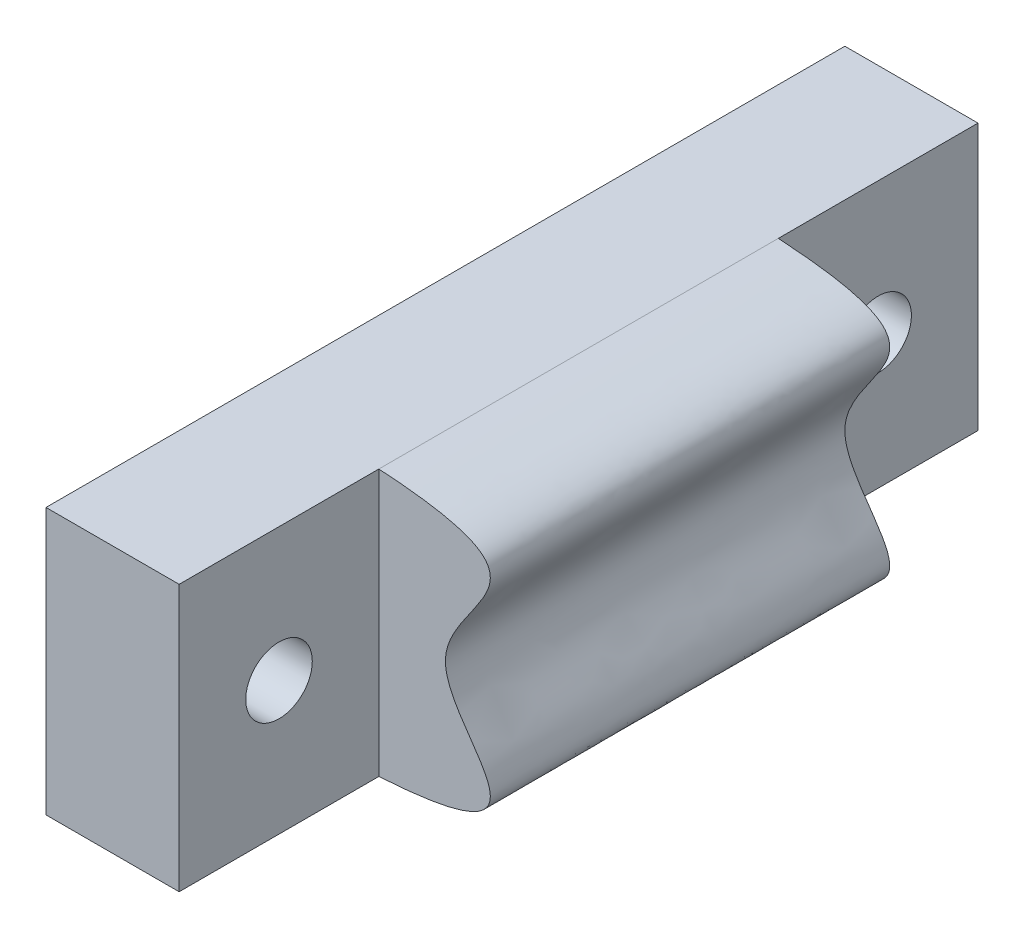
ISO-10303-21;
HEADER;
FILE_DESCRIPTION(('STEP AP214'),'2;1');
FILE_NAME('part.step','',(''),(''),'','','');
FILE_SCHEMA(('AUTOMOTIVE_DESIGN { 1 0 10303 214 1 1 1 1 }'));
ENDSEC;
DATA;
#1=APPLICATION_CONTEXT('core data for automotive mechanical design processes');
#2=APPLICATION_PROTOCOL_DEFINITION('international standard','automotive_design',2000,#1);
#3=PRODUCT_CONTEXT('',#1,'mechanical');
#4=PRODUCT('Part','Part','',(#3));
#5=PRODUCT_RELATED_PRODUCT_CATEGORY('part','',(#4));
#6=PRODUCT_DEFINITION_FORMATION('','',#4);
#7=PRODUCT_DEFINITION_CONTEXT('part definition',#1,'design');
#8=PRODUCT_DEFINITION('design','',#6,#7);
#9=PRODUCT_DEFINITION_SHAPE('','',#8);
#10=(LENGTH_UNIT() NAMED_UNIT(*) SI_UNIT(.MILLI.,.METRE.));
#11=(NAMED_UNIT(*) PLANE_ANGLE_UNIT() SI_UNIT($,.RADIAN.));
#12=(NAMED_UNIT(*) SI_UNIT($,.STERADIAN.) SOLID_ANGLE_UNIT());
#13=UNCERTAINTY_MEASURE_WITH_UNIT(LENGTH_MEASURE(1.E-05),#10,'distance_accuracy_value','');
#14=(GEOMETRIC_REPRESENTATION_CONTEXT(3) GLOBAL_UNCERTAINTY_ASSIGNED_CONTEXT((#13)) GLOBAL_UNIT_ASSIGNED_CONTEXT((#10,
#11,#12)) REPRESENTATION_CONTEXT('',''));
#15=CARTESIAN_POINT('',(0.,0.,0.));
#16=DIRECTION('',(0.,0.,1.));
#17=DIRECTION('',(1.,0.,0.));
#18=AXIS2_PLACEMENT_3D('',#15,#16,#17);
#19=CARTESIAN_POINT('',(6.35,-12.7,76.2));
#20=CARTESIAN_POINT('',(25.71525174844,-11.5044863284385,76.2));
#21=CARTESIAN_POINT('',(-0.315251748439956,0.,76.2));
#22=CARTESIAN_POINT('',(25.71525174844,11.5044863284385,76.2));
#23=CARTESIAN_POINT('',(6.35,12.7,76.2));
#24=B_SPLINE_CURVE_WITH_KNOTS('',3,(#19,#20,#21,#22,#23),.UNSPECIFIED.,.F.,.F.,(4,1,4),(0.,0.5,
1.),.UNSPECIFIED.);
#25=DIRECTION('',(0.,0.,-1.));
#26=VECTOR('',#25,1.);
#27=SURFACE_OF_LINEAR_EXTRUSION('',#24,#26);
#28=CARTESIAN_POINT('',(6.35,12.7,19.05));
#29=CARTESIAN_POINT('',(6.59042784638858,12.6851486091138,19.05));
#30=CARTESIAN_POINT('',(6.83079729121116,12.6693067910446,19.05));
#31=CARTESIAN_POINT('',(7.31216673099985,12.6353112674344,19.05));
#32=CARTESIAN_POINT('',(7.55316619965954,12.6171501295011,19.05));
#33=CARTESIAN_POINT('',(8.03551660957306,12.5782341399885,19.05));
#34=CARTESIAN_POINT('',(8.27686707928766,12.5574734022697,19.05));
#35=CARTESIAN_POINT('',(8.7596327181866,12.5130057301667,19.05));
#36=CARTESIAN_POINT('',(9.00104751987589,12.4892947832721,19.05));
#37=CARTESIAN_POINT('',(9.48364948176947,12.438500801537,19.05));
#38=CARTESIAN_POINT('',(9.72483646195453,12.4114160451251,19.05));
#39=CARTESIAN_POINT('',(10.2068871728875,12.3533187497638,19.05));
#40=CARTESIAN_POINT('',(10.4477506229266,12.322303864329,19.05));
#41=CARTESIAN_POINT('',(10.9286972043699,12.2556775914973,19.05));
#42=CARTESIAN_POINT('',(11.1687807200965,12.2200690000518,19.05));
#43=CARTESIAN_POINT('',(11.6478526504472,12.1433604360711,19.05));
#44=CARTESIAN_POINT('',(11.8868418670211,12.1022655259011,19.05));
#45=CARTESIAN_POINT('',(12.363352463959,12.0133712919053,19.05));
#46=CARTESIAN_POINT('',(12.6008749946784,11.965578185614,19.05));
#47=CARTESIAN_POINT('',(13.0740273187668,11.8615881566732,19.05));
#48=CARTESIAN_POINT('',(13.3096577341428,11.8053941257764,19.05));
#49=CARTESIAN_POINT('',(13.6725787844795,11.7098825073265,19.05));
#50=CARTESIAN_POINT('',(13.8008690658955,11.6743621849815,19.05));
#51=CARTESIAN_POINT('',(14.0563451587935,11.5994554540191,19.05));
#52=CARTESIAN_POINT('',(14.1835308034997,11.5600684722977,19.05));
#53=CARTESIAN_POINT('',(14.4372681119949,11.4764487115584,19.05));
#54=CARTESIAN_POINT('',(14.5638096072557,11.432184845445,19.05));
#55=CARTESIAN_POINT('',(14.8148111484126,11.3381099045429,19.05));
#56=CARTESIAN_POINT('',(14.9392715004484,11.2882996540421,19.05));
#57=CARTESIAN_POINT('',(15.1874447938806,11.1809917107246,19.05));
#58=CARTESIAN_POINT('',(15.3111069862292,11.1233752637353,19.05));
#59=CARTESIAN_POINT('',(15.5541890828716,10.9994145159972,19.05));
#60=CARTESIAN_POINT('',(15.6736049833975,10.933062241729,19.05));
#61=CARTESIAN_POINT('',(15.9047847620829,10.7901630550656,19.05));
#62=CARTESIAN_POINT('',(16.0166086415941,10.713714943614,19.05));
#63=CARTESIAN_POINT('',(16.2299818204799,10.5478265310336,19.05));
#64=CARTESIAN_POINT('',(16.3315571907641,10.458420682417,19.05));
#65=CARTESIAN_POINT('',(16.5004897941862,10.2834164706421,19.05));
#66=CARTESIAN_POINT('',(16.5706390092464,10.2005747946956,19.05));
#67=CARTESIAN_POINT('',(16.6653484118405,10.0688135237832,19.05));
#68=CARTESIAN_POINT('',(16.6951657638259,10.0236433980342,19.05));
#69=CARTESIAN_POINT('',(16.7508235724111,9.93092701267313,19.05));
#70=CARTESIAN_POINT('',(16.7766658518275,9.88338185549005,19.05));
#71=CARTESIAN_POINT('',(16.8241430777735,9.78575441661989,19.05));
#72=CARTESIAN_POINT('',(16.8457423696507,9.73565474963264,19.05));
#73=CARTESIAN_POINT('',(16.8841551122953,9.63365287672314,19.05));
#74=CARTESIAN_POINT('',(16.9009687506723,9.58175074155169,19.05));
#75=CARTESIAN_POINT('',(16.9296738829585,9.47658603421905,19.05));
#76=CARTESIAN_POINT('',(16.9415637001548,9.42332300517607,19.05));
#77=CARTESIAN_POINT('',(16.9604673887898,9.31594095293583,19.05));
#78=CARTESIAN_POINT('',(16.9674806823452,9.2618218290656,19.05));
#79=CARTESIAN_POINT('',(16.9776080628006,9.14444777921161,19.05));
#80=CARTESIAN_POINT('',(16.9799135886404,9.08112346190272,19.05));
#81=CARTESIAN_POINT('',(16.9788121199908,8.954519480085,19.05));
#82=CARTESIAN_POINT('',(16.9754025902639,8.89123984785769,19.05));
#83=CARTESIAN_POINT('',(16.963530195346,8.76505927701433,19.05));
#84=CARTESIAN_POINT('',(16.9550584332405,8.70215920253764,19.05));
#85=CARTESIAN_POINT('',(16.933737748447,8.57712694524289,19.05));
#86=CARTESIAN_POINT('',(16.9208889811999,8.5149947352368,19.05));
#87=CARTESIAN_POINT('',(16.8726167908278,8.31258379647794,19.05));
#88=CARTESIAN_POINT('',(16.8293609012574,8.17416642184426,19.05));
#89=CARTESIAN_POINT('',(16.7295737329903,7.90216776066648,19.05));
#90=CARTESIAN_POINT('',(16.6730173820525,7.76859616448499,19.05));
#91=CARTESIAN_POINT('',(16.5504066047323,7.50494362005501,19.05));
#92=CARTESIAN_POINT('',(16.4842956902542,7.37488931622632,19.05));
#93=CARTESIAN_POINT('',(16.345748355195,7.11841896261184,19.05));
#94=CARTESIAN_POINT('',(16.2733184485427,6.99199934070204,19.05));
#95=CARTESIAN_POINT('',(16.1426680869893,6.77309198760302,19.05));
#96=CARTESIAN_POINT('',(16.0854192012478,6.68001860292257,19.05));
#97=CARTESIAN_POINT('',(15.9690206663383,6.4950651794787,19.05));
#98=CARTESIAN_POINT('',(15.9098709308332,6.40318519518681,19.05));
#99=CARTESIAN_POINT('',(15.730309844506,6.12886398570775,19.05));
#100=CARTESIAN_POINT('',(15.6078170677741,5.94779126363268,19.05));
#101=CARTESIAN_POINT('',(15.3601150051994,5.58704083336464,19.05));
#102=CARTESIAN_POINT('',(15.2349010618719,5.4073663725095,19.05));
#103=CARTESIAN_POINT('',(14.9843446095797,5.04815043102188,19.05));
#104=CARTESIAN_POINT('',(14.8590021259288,4.86860893304327,19.05));
#105=CARTESIAN_POINT('',(14.6106008794613,4.50864171188273,19.05));
#106=CARTESIAN_POINT('',(14.4875369652071,4.3282195698727,19.05));
#107=CARTESIAN_POINT('',(14.2454733443937,3.9646747207015,19.05));
#108=CARTESIAN_POINT('',(14.1264731761072,3.78155232375413,19.05));
#109=CARTESIAN_POINT('',(13.8951133427065,3.41160068161481,19.05));
#110=CARTESIAN_POINT('',(13.7827416945253,3.22477899544818,19.05));
#111=CARTESIAN_POINT('',(13.5673177384189,2.84587051206603,19.05));
#112=CARTESIAN_POINT('',(13.4642612456526,2.6537861301712,19.05));
#113=CARTESIAN_POINT('',(13.2915606493946,2.30440039046037,19.05));
#114=CARTESIAN_POINT('',(13.2194574138961,2.14832400028748,19.05));
#115=CARTESIAN_POINT('',(13.0856545273869,1.83162064386352,19.05));
#116=CARTESIAN_POINT('',(13.0239598317834,1.67099155238136,19.05));
#117=CARTESIAN_POINT('',(12.9142626740997,1.34625836700613,19.05));
#118=CARTESIAN_POINT('',(12.8661711341422,1.18218481412932,19.05));
#119=CARTESIAN_POINT('',(12.7864948482938,0.850055293014299,19.05));
#120=CARTESIAN_POINT('',(12.7548967993124,0.682002648909292,19.05));
#121=CARTESIAN_POINT('',(12.7224630900641,0.427862605623435,19.05));
#122=CARTESIAN_POINT('',(12.7141447671754,0.342700060604403,19.05));
#123=CARTESIAN_POINT('',(12.7029242195879,0.17201068430444,19.05));
#124=CARTESIAN_POINT('',(12.7000214655925,0.0864838894428777,19.05));
#125=CARTESIAN_POINT('',(12.6999787804678,-0.0845459280890896,19.05));
#126=CARTESIAN_POINT('',(12.702837273811,-0.17004895086514,19.05));
#127=CARTESIAN_POINT('',(12.7139835932115,-0.340874413806422,19.05));
#128=CARTESIAN_POINT('',(12.7222829818152,-0.426196080301704,19.05));
#129=CARTESIAN_POINT('',(12.7439180346471,-0.596227217541584,19.05));
#130=CARTESIAN_POINT('',(12.7572557606415,-0.680936423175517,19.05));
#131=CARTESIAN_POINT('',(12.7885294486524,-0.849508039007428,19.05));
#132=CARTESIAN_POINT('',(12.8064662918641,-0.933370283722814,19.05));
#133=CARTESIAN_POINT('',(12.8564020491618,-1.14136557509397,19.05));
#134=CARTESIAN_POINT('',(12.8909667759371,-1.26488504663358,19.05));
#135=CARTESIAN_POINT('',(12.9679637566536,-1.50945772818059,19.05));
#136=CARTESIAN_POINT('',(13.010398963989,-1.6305099933814,19.05));
#137=CARTESIAN_POINT('',(13.101865770417,-1.87011610984887,19.05));
#138=CARTESIAN_POINT('',(13.1508992240181,-1.98866924783423,19.05));
#139=CARTESIAN_POINT('',(13.2546967112538,-2.2239137396866,19.05));
#140=CARTESIAN_POINT('',(13.3094875577953,-2.34059317593437,19.05));
#141=CARTESIAN_POINT('',(13.4236175029598,-2.5716341091507,19.05));
#142=CARTESIAN_POINT('',(13.4829547382186,-2.68599653171698,19.05));
#143=CARTESIAN_POINT('',(13.6053617767292,-2.91264057739806,19.05));
#144=CARTESIAN_POINT('',(13.6684301934706,-3.02492295334472,19.05));
#145=CARTESIAN_POINT('',(13.8415666969623,-3.32349879933655,19.05));
#146=CARTESIAN_POINT('',(13.9544189925907,-3.50817460643326,19.05));
#147=CARTESIAN_POINT('',(14.1860272269202,-3.87381136376711,19.05));
#148=CARTESIAN_POINT('',(14.304784832236,-4.05477124469001,19.05));
#149=CARTESIAN_POINT('',(14.5460818478106,-4.41445371518038,19.05));
#150=CARTESIAN_POINT('',(14.6686256747832,-4.59317332149776,19.05));
#151=CARTESIAN_POINT('',(14.9154916545184,-4.94974584879362,19.05));
#152=CARTESIAN_POINT('',(15.0398160822621,-5.1275971817283,19.05));
#153=CARTESIAN_POINT('',(15.2871958481321,-5.48245866256782,19.05));
#154=CARTESIAN_POINT('',(15.410254174044,-5.65946672776899,19.05));
#155=CARTESIAN_POINT('',(15.6535250516805,-6.01524869395567,19.05));
#156=CARTESIAN_POINT('',(15.7737398045538,-6.19402106644454,19.05));
#157=CARTESIAN_POINT('',(15.9495920148884,-6.46482814684223,19.05));
#158=CARTESIAN_POINT('',(16.0074069212299,-6.55544348203739,19.05));
#159=CARTESIAN_POINT('',(16.1210823041173,-6.73788879954552,19.05));
#160=CARTESIAN_POINT('',(16.1769429123926,-6.82971869941359,19.05));
#161=CARTESIAN_POINT('',(16.2860342826741,-7.01478568652309,19.05));
#162=CARTESIAN_POINT('',(16.3392681221281,-7.10802095155358,19.05));
#163=CARTESIAN_POINT('',(16.4423843048995,-7.29631889865157,19.05));
#164=CARTESIAN_POINT('',(16.4922673359164,-7.39138120056653,19.05));
#165=CARTESIAN_POINT('',(16.5728937572965,-7.55393294119716,19.05));
#166=CARTESIAN_POINT('',(16.604783516398,-7.62085269175014,19.05));
#167=CARTESIAN_POINT('',(16.6660457150327,-7.75586368971007,19.05));
#168=CARTESIAN_POINT('',(16.6954174723218,-7.82395524865159,19.05));
#169=CARTESIAN_POINT('',(16.7511745604178,-7.96156303254377,19.05));
#170=CARTESIAN_POINT('',(16.7775520269563,-8.03108246748831,19.05));
#171=CARTESIAN_POINT('',(16.8265746119746,-8.17143557805991,19.05));
#172=CARTESIAN_POINT('',(16.8492198393133,-8.24226921528832,19.05));
#173=CARTESIAN_POINT('',(16.8902808819013,-8.38630522183876,19.05));
#174=CARTESIAN_POINT('',(16.9086291275314,-8.45952713377872,19.05));
#175=CARTESIAN_POINT('',(16.939665690286,-8.60719830447996,19.05));
#176=CARTESIAN_POINT('',(16.9523532240015,-8.68164773164458,19.05));
#177=CARTESIAN_POINT('',(16.9709013112331,-8.83112576531166,19.05));
#178=CARTESIAN_POINT('',(16.9767883510568,-8.90615097131389,19.05));
#179=CARTESIAN_POINT('',(16.9806704136888,-9.0564038162815,19.05));
#180=CARTESIAN_POINT('',(16.978671072723,-9.13163127229228,19.05));
#181=CARTESIAN_POINT('',(16.9679321502818,-9.25691868878651,19.05));
#182=CARTESIAN_POINT('',(16.9616015131981,-9.30719092016678,19.05));
#183=CARTESIAN_POINT('',(16.9447478191422,-9.40702659982085,19.05));
#184=CARTESIAN_POINT('',(16.9342256443497,-9.45659019496672,19.05));
#185=CARTESIAN_POINT('',(16.9089316977791,-9.55460718612092,19.05));
#186=CARTESIAN_POINT('',(16.8941611533443,-9.60306089841305,19.05));
#187=CARTESIAN_POINT('',(16.8604494421327,-9.69851204919213,19.05));
#188=CARTESIAN_POINT('',(16.8415068945815,-9.74550899965824,19.05));
#189=CARTESIAN_POINT('',(16.7997469444525,-9.83754543260496,19.05));
#190=CARTESIAN_POINT('',(16.7769435096793,-9.88259126102047,19.05));
#191=CARTESIAN_POINT('',(16.7277366187068,-9.97068017593033,19.05));
#192=CARTESIAN_POINT('',(16.7013316549594,-10.0137224135768,19.05));
#193=CARTESIAN_POINT('',(16.6172028601415,-10.1397220445346,19.05));
#194=CARTESIAN_POINT('',(16.5546047402777,-10.2194672975734,19.05));
#195=CARTESIAN_POINT('',(16.4326715736294,-10.3556756405489,19.05));
#196=CARTESIAN_POINT('',(16.3750008717521,-10.4136750614401,19.05));
#197=CARTESIAN_POINT('',(16.2548234394676,-10.5242944906707,19.05));
#198=CARTESIAN_POINT('',(16.19232089071,-10.5769190610235,19.05));
#199=CARTESIAN_POINT('',(16.0633601460733,-10.6775430264651,19.05));
#200=CARTESIAN_POINT('',(15.9968880844935,-10.7255244651979,19.05));
#201=CARTESIAN_POINT('',(15.8610659002617,-10.817213672676,19.05));
#202=CARTESIAN_POINT('',(15.7917152642655,-10.8609206744445,19.05));
#203=CARTESIAN_POINT('',(15.5927031534406,-10.9791019261101,19.05));
#204=CARTESIAN_POINT('',(15.4604622108911,-11.0492300300963,19.05));
#205=CARTESIAN_POINT('',(15.1911374745231,-11.1798091881666,19.05));
#206=CARTESIAN_POINT('',(15.0540461684471,-11.2402443502142,19.05));
#207=CARTESIAN_POINT('',(14.7766048524188,-11.3533775100854,19.05));
#208=CARTESIAN_POINT('',(14.6362522357566,-11.4060690536644,19.05));
#209=CARTESIAN_POINT('',(14.3519008645872,-11.5056613231334,19.05));
#210=CARTESIAN_POINT('',(14.2078794081643,-11.5524964759976,19.05));
#211=CARTESIAN_POINT('',(13.9183978178534,-11.6408371008842,19.05));
#212=CARTESIAN_POINT('',(13.7729394460322,-11.6823483945279,19.05));
#213=CARTESIAN_POINT('',(13.4809005344559,-11.7609561290278,19.05));
#214=CARTESIAN_POINT('',(13.3343204206373,-11.7980541649427,19.05));
#215=CARTESIAN_POINT('',(12.9951017119061,-11.8793570702382,19.05));
#216=CARTESIAN_POINT('',(12.8021481763637,-11.9222437248258,19.05));
#217=CARTESIAN_POINT('',(12.4151173258233,-12.0028154960331,19.05));
#218=CARTESIAN_POINT('',(12.221039727684,-12.0404992369093,19.05));
#219=CARTESIAN_POINT('',(11.8319726176491,-12.1115259671534,19.05));
#220=CARTESIAN_POINT('',(11.6369826151964,-12.1448662522471,19.05));
#221=CARTESIAN_POINT('',(11.2462758969351,-12.2078584219084,19.05));
#222=CARTESIAN_POINT('',(11.0505587775004,-12.2375077859848,19.05));
#223=CARTESIAN_POINT('',(10.658559166077,-12.293624843648,19.05));
#224=CARTESIAN_POINT('',(10.4622764180548,-12.3200907387459,19.05));
#225=CARTESIAN_POINT('',(10.0692909276253,-12.3702445010532,19.05));
#226=CARTESIAN_POINT('',(9.87258806606556,-12.3939314299739,19.05));
#227=CARTESIAN_POINT('',(9.49108213658496,-12.4374639423518,19.05));
#228=CARTESIAN_POINT('',(9.30629575139044,-12.4574565161464,19.05));
#229=CARTESIAN_POINT('',(8.93657775725389,-12.4955086766502,19.05));
#230=CARTESIAN_POINT('',(8.75164620445941,-12.5135688107143,19.05));
#231=CARTESIAN_POINT('',(8.38175370034258,-12.5479446831651,19.05));
#232=CARTESIAN_POINT('',(8.19679286253431,-12.5642616475335,19.05));
#233=CARTESIAN_POINT('',(7.82695520592179,-12.5953123384825,19.05));
#234=CARTESIAN_POINT('',(7.64207853927486,-12.6100478829551,19.05));
#235=CARTESIAN_POINT('',(7.27252115946913,-12.6380763621326,19.05));
#236=CARTESIAN_POINT('',(7.08784062194907,-12.651371622263,19.05));
#237=CARTESIAN_POINT('',(6.71878504644686,-12.676638375484,19.05));
#238=CARTESIAN_POINT('',(6.53441019811627,-12.688612634418,19.05));
#239=CARTESIAN_POINT('',(6.35,-12.7,19.05));
#240=B_SPLINE_CURVE_WITH_KNOTS('',3,(#28,#29,#30,#31,#32,#33,#34,#35,#36,#37,#38,#39,#40,#41,
#42,#43,#44,#45,#46,#47,#48,#49,#50,#51,#52,#53,#54,#55,#56,#57,#58,#59,#60,#61,#62,#63,#64,#65,
#66,#67,#68,#69,#70,#71,#72,#73,#74,#75,#76,#77,#78,#79,#80,#81,#82,#83,#84,#85,#86,#87,#88,#89,
#90,#91,#92,#93,#94,#95,#96,#97,#98,#99,#100,#101,#102,#103,#104,#105,#106,#107,#108,#109,#110,
#111,#112,#113,#114,#115,#116,#117,#118,#119,#120,#121,#122,#123,#124,#125,#126,#127,#128,#129,
#130,#131,#132,#133,#134,#135,#136,#137,#138,#139,#140,#141,#142,#143,#144,#145,#146,#147,#148,
#149,#150,#151,#152,#153,#154,#155,#156,#157,#158,#159,#160,#161,#162,#163,#164,#165,#166,#167,
#168,#169,#170,#171,#172,#173,#174,#175,#176,#177,#178,#179,#180,#181,#182,#183,#184,#185,#186,
#187,#188,#189,#190,#191,#192,#193,#194,#195,#196,#197,#198,#199,#200,#201,#202,#203,#204,#205,
#206,#207,#208,#209,#210,#211,#212,#213,#214,#215,#216,#217,#218,#219,#220,#221,#222,#223,#224,
#225,#226,#227,#228,#229,#230,#231,#232,#233,#234,#235,#236,#237,#238,#239),.UNSPECIFIED.,.F.,
.F.,(4,2,2,2,2,2,2,2,2,2,2,2,2,2,2,2,2,2,2,2,2,2,2,2,2,2,2,2,2,2,2,2,2,2,2,2,2,2,2,2,2,2,2,2,2,
2,2,2,2,2,2,2,2,2,2,2,2,2,2,2,2,2,2,2,2,2,2,2,2,2,2,2,2,2,2,2,2,2,2,2,2,2,2,2,2,2,2,2,2,2,2,2,2,
2,2,2,2,2,2,2,2,2,2,2,2,4),(0.,0.722660378639619,1.44769757534735,2.17440717288135,
2.90211618241953,3.6301980568075,4.35871669928291,5.0867940038795,5.81420407749095,
6.54094335766948,7.2674330543536,7.66673579479884,8.06609780824295,8.46817149283465,
8.87018550193007,9.27919949959204,9.68858944195853,10.0942347285194,10.49882061068,
10.8232280669674,10.985431193505,11.147559716709,11.3109972656844,11.4744284066146,
11.6379151552141,11.8014212742014,11.9912252451896,12.1811134367957,12.371336344087,
12.5615524966843,12.9954602111579,13.4301925209131,13.8676090066968,14.3045797927721,
14.6323662303481,14.9601675771893,15.6159451952043,16.2729508475821,16.9298454282409,
17.5850074263638,18.240094734919,18.8939589907065,19.547528022084,20.0630190985723,
20.5787549071147,21.091030900573,21.602893068633,21.8594540487168,22.1159899522181,
22.3724557104022,22.6294682631476,22.886586103565,23.1437532448586,23.5282137633216,
23.9128188433811,24.2975322475103,24.6841241795759,25.070558503633,25.4568501194974,
26.1059468012336,26.7552277244109,27.4052969911663,28.0562879274859,28.7030314540123,
29.3492567832038,29.6717029512189,29.9941273427196,30.3161645573213,30.6381354757331,
30.8604826809797,31.0828899412911,31.3058684447922,31.5288404434863,31.755113069839,
31.9814170012771,32.2068365289201,32.4320949832991,32.5839431528617,32.7357593802904,
32.8875317923663,33.03935451102,33.1906392683731,33.341987546802,33.644962457144,
33.8900112396124,34.1348502726458,34.3806012031877,34.6263961490603,35.0748592104818,
35.5240501934696,35.9736134756487,36.4278293205247,36.8815441685115,37.3350945314624,
37.9279878282348,38.5210375975895,39.1144548580953,39.7082751595343,40.302429377394,
40.8967836313411,41.4543668749223,42.0117917651139,42.5688219976986,43.125204888422,
43.6806756390774,44.2349603704176),.UNSPECIFIED.);
#241=CARTESIAN_POINT('',(6.35,12.7,19.05));
#242=VERTEX_POINT('',#241);
#243=CARTESIAN_POINT('',(6.35,-12.7,19.05));
#244=VERTEX_POINT('',#243);
#245=EDGE_CURVE('E102',#242,#244,#240,.T.);
#246=ORIENTED_EDGE('',*,*,#245,.F.);
#247=DIRECTION('',(0.,0.,-1.));
#248=VECTOR('',#247,1.);
#249=CARTESIAN_POINT('',(6.35,12.7,76.2));
#250=LINE('',#249,#248);
#251=CARTESIAN_POINT('',(6.35,12.7,57.15));
#252=VERTEX_POINT('',#251);
#253=EDGE_CURVE('E48',#252,#242,#250,.T.);
#254=ORIENTED_EDGE('',*,*,#253,.F.);
#255=CARTESIAN_POINT('',(6.35,-12.7,57.15));
#256=CARTESIAN_POINT('',(6.55047275612908,-12.6876198386035,57.15));
#257=CARTESIAN_POINT('',(6.7509040303344,-12.674547346413,57.15));
#258=CARTESIAN_POINT('',(7.15192624063259,-12.6468460282459,57.15));
#259=CARTESIAN_POINT('',(7.3525170352915,-12.6322151585632,57.15));
#260=CARTESIAN_POINT('',(7.75375532059156,-12.6012430434155,57.15));
#261=CARTESIAN_POINT('',(7.95440268969981,-12.5849002158697,57.15));
#262=CARTESIAN_POINT('',(8.35564779550333,-12.5503183036077,57.15));
#263=CARTESIAN_POINT('',(8.55624544144559,-12.5320781618672,57.15));
#264=CARTESIAN_POINT('',(8.95728244561518,-12.4934846186212,57.15));
#265=CARTESIAN_POINT('',(9.15772175960901,-12.4731307556346,57.15));
#266=CARTESIAN_POINT('',(9.56599468861103,-12.4292268888608,57.15));
#267=CARTESIAN_POINT('',(9.7738184252103,-12.4055845244317,57.15));
#268=CARTESIAN_POINT('',(10.1890617497275,-12.3553896046109,57.15));
#269=CARTESIAN_POINT('',(10.3964814278607,-12.3288377994435,57.15));
#270=CARTESIAN_POINT('',(10.8107838874282,-12.2723874023656,57.15));
#271=CARTESIAN_POINT('',(11.0176668492695,-12.2424901428635,57.15));
#272=CARTESIAN_POINT('',(11.4307463600877,-12.1787973074728,57.15));
#273=CARTESIAN_POINT('',(11.6369431612775,-12.145003377317,57.15));
#274=CARTESIAN_POINT('',(12.0484816257396,-12.0728058274265,57.15));
#275=CARTESIAN_POINT('',(12.2538234945526,-12.0344033908433,57.15));
#276=CARTESIAN_POINT('',(12.6277429026365,-11.9592145947022,57.15));
#277=CARTESIAN_POINT('',(12.7964971911793,-11.9233108316644,57.15));
#278=CARTESIAN_POINT('',(13.1330459351531,-11.8470125652173,57.15));
#279=CARTESIAN_POINT('',(13.300840104987,-11.8066167919028,57.15));
#280=CARTESIAN_POINT('',(13.6352098380145,-11.7204060321793,57.15));
#281=CARTESIAN_POINT('',(13.8017841105563,-11.6745859982086,57.15));
#282=CARTESIAN_POINT('',(14.1318043389005,-11.5767115407985,57.15));
#283=CARTESIAN_POINT('',(14.2952642053063,-11.5247045889971,57.15));
#284=CARTESIAN_POINT('',(14.6192944478436,-11.4126367829385,57.15));
#285=CARTESIAN_POINT('',(14.7798668193392,-11.3525817534371,57.15));
#286=CARTESIAN_POINT('',(15.0966490588541,-11.2222539059238,57.15));
#287=CARTESIAN_POINT('',(15.2528649336655,-11.1519960800255,57.15));
#288=CARTESIAN_POINT('',(15.4879140596458,-11.0336567050854,57.15));
#289=CARTESIAN_POINT('',(15.5691412715086,-10.9903344245642,57.15));
#290=CARTESIAN_POINT('',(15.7290573434218,-10.8991540493646,57.15));
#291=CARTESIAN_POINT('',(15.8077455772184,-10.8512948469196,57.15));
#292=CARTESIAN_POINT('',(15.9615315019088,-10.7504415629251,57.15));
#293=CARTESIAN_POINT('',(16.0366372952209,-10.6974599778969,57.15));
#294=CARTESIAN_POINT('',(16.1822084566793,-10.5855313222077,57.15));
#295=CARTESIAN_POINT('',(16.25267670478,-10.5265880126472,57.15));
#296=CARTESIAN_POINT('',(16.4030674910049,-10.3874218283321,57.15));
#297=CARTESIAN_POINT('',(16.4814080138747,-10.3054301190606,57.15));
#298=CARTESIAN_POINT('',(16.5887679947656,-10.1742180590888,57.15));
#299=CARTESIAN_POINT('',(16.6228605368507,-10.1291138870865,57.15));
#300=CARTESIAN_POINT('',(16.6871116880801,-10.0361978618786,57.15));
#301=CARTESIAN_POINT('',(16.7172723309265,-9.98838742693852,57.15));
#302=CARTESIAN_POINT('',(16.7734442097271,-9.88965653415703,57.15));
#303=CARTESIAN_POINT('',(16.7994043444693,-9.83870688636007,57.15));
#304=CARTESIAN_POINT('',(16.8462832996112,-9.73453482417501,57.15));
#305=CARTESIAN_POINT('',(16.8672023236563,-9.68131250169827,57.15));
#306=CARTESIAN_POINT('',(16.9036969752715,-9.57306844464789,57.15));
#307=CARTESIAN_POINT('',(16.9192730438647,-9.51804685900148,57.15));
#308=CARTESIAN_POINT('',(16.9450146864446,-9.40676834628052,57.15));
#309=CARTESIAN_POINT('',(16.9551803526756,-9.35051144028447,57.15));
#310=CARTESIAN_POINT('',(16.9758336290273,-9.19519266198649,57.15));
#311=CARTESIAN_POINT('',(16.980946533906,-9.09538868710488,57.15));
#312=CARTESIAN_POINT('',(16.9771652730245,-8.89618171614455,57.15));
#313=CARTESIAN_POINT('',(16.9682673178245,-8.79677883583826,57.15));
#314=CARTESIAN_POINT('',(16.9399545244415,-8.60496565469313,57.15));
#315=CARTESIAN_POINT('',(16.9211236500798,-8.51246445863721,57.15));
#316=CARTESIAN_POINT('',(16.8754314820273,-8.32943017056753,57.15));
#317=CARTESIAN_POINT('',(16.8485627596121,-8.23889898266458,57.15));
#318=CARTESIAN_POINT('',(16.7884244472677,-8.05959160942402,57.15));
#319=CARTESIAN_POINT('',(16.7551278066098,-7.97082465429432,57.15));
#320=CARTESIAN_POINT('',(16.6836167016985,-7.79538289555145,57.15));
#321=CARTESIAN_POINT('',(16.6454052794234,-7.70870683687037,57.15));
#322=CARTESIAN_POINT('',(16.5606259552676,-7.52758805482755,57.15));
#323=CARTESIAN_POINT('',(16.5136014174222,-7.43336069385774,57.15));
#324=CARTESIAN_POINT('',(16.4158790721788,-7.24682041633894,57.15));
#325=CARTESIAN_POINT('',(16.3651804459721,-7.15450793247254,57.15));
#326=CARTESIAN_POINT('',(16.2608816237671,-6.97135194784016,57.15));
#327=CARTESIAN_POINT('',(16.2072769549594,-6.88051100808539,57.15));
#328=CARTESIAN_POINT('',(16.0978911364446,-6.70014539282205,57.15));
#329=CARTESIAN_POINT('',(16.0421098109855,-6.61062082440941,57.15));
#330=CARTESIAN_POINT('',(15.8720347715282,-6.34317421984152,57.15));
#331=CARTESIAN_POINT('',(15.7552725387291,-6.16682777650741,57.15));
#332=CARTESIAN_POINT('',(15.5182699526266,-5.81632592504875,57.15));
#333=CARTESIAN_POINT('',(15.3980269769754,-5.64217231860371,57.15));
#334=CARTESIAN_POINT('',(15.1561856178096,-5.2942183873384,57.15));
#335=CARTESIAN_POINT('',(15.034584756484,-5.12041979124887,57.15));
#336=CARTESIAN_POINT('',(14.7924978661869,-4.77249078379809,57.15));
#337=CARTESIAN_POINT('',(14.672010269363,-4.59836147085626,57.15));
#338=CARTESIAN_POINT('',(14.4339659252502,-4.24841086249087,57.15));
#339=CARTESIAN_POINT('',(14.3164057531148,-4.07259191340663,57.15));
#340=CARTESIAN_POINT('',(14.0860815443959,-3.71785788401877,57.15));
#341=CARTESIAN_POINT('',(13.9733165864356,-3.53894340788524,57.15));
#342=CARTESIAN_POINT('',(13.7762047759395,-3.21210099457453,57.15));
#343=CARTESIAN_POINT('',(13.6906042270844,-3.06493377241323,57.15));
#344=CARTESIAN_POINT('',(13.5254698168115,-2.76712179370614,57.15));
#345=CARTESIAN_POINT('',(13.4459388200268,-2.61647543828099,57.15));
#346=CARTESIAN_POINT('',(13.2947644130073,-2.31111642710987,57.15));
#347=CARTESIAN_POINT('',(13.2231253074438,-2.15640160863139,57.15));
#348=CARTESIAN_POINT('',(13.0900990902958,-1.84270932142451,57.15));
#349=CARTESIAN_POINT('',(13.02870798622,-1.68373354085863,57.15));
#350=CARTESIAN_POINT('',(12.8913226766597,-1.28018051004042,57.15));
#351=CARTESIAN_POINT('',(12.8234307236341,-1.03263442311581,57.15));
#352=CARTESIAN_POINT('',(12.7522430647455,-0.656172496021274,57.15));
#353=CARTESIAN_POINT('',(12.7336296200471,-0.53010625491261,57.15));
#354=CARTESIAN_POINT('',(12.7079067537406,-0.276800144228782,57.15));
#355=CARTESIAN_POINT('',(12.7007920044483,-0.149560845665014,57.15));
#356=CARTESIAN_POINT('',(12.6993339464574,0.10570584398339,57.15));
#357=CARTESIAN_POINT('',(12.7050626044159,0.233733647046639,57.15));
#358=CARTESIAN_POINT('',(12.7283302366804,0.488726215985577,57.15));
#359=CARTESIAN_POINT('',(12.7458748668179,0.615690443291177,57.15));
#360=CARTESIAN_POINT('',(12.791397313254,0.868215874681189,57.15));
#361=CARTESIAN_POINT('',(12.8194159317862,0.993769587420097,57.15));
#362=CARTESIAN_POINT('',(12.8843789956143,1.24248153975592,57.15));
#363=CARTESIAN_POINT('',(12.9213217832377,1.3656402196471,57.15));
#364=CARTESIAN_POINT('',(13.0267383681848,1.68132190633022,57.15));
#365=CARTESIAN_POINT('',(13.1009594053233,1.8719218217822,57.15));
#366=CARTESIAN_POINT('',(13.2637202356049,2.24714823275132,57.15));
#367=CARTESIAN_POINT('',(13.3522851180591,2.43176356875986,57.15));
#368=CARTESIAN_POINT('',(13.5400349891944,2.79573567425381,57.15));
#369=CARTESIAN_POINT('',(13.6392327515235,2.97508578152029,57.15));
#370=CARTESIAN_POINT('',(13.846694859053,3.33177202526106,57.15));
#371=CARTESIAN_POINT('',(13.955066418602,3.50904512067689,57.15));
#372=CARTESIAN_POINT('',(14.1770974139563,3.85985971964076,57.15));
#373=CARTESIAN_POINT('',(14.2907489749139,4.03340624954698,57.15));
#374=CARTESIAN_POINT('',(14.5213110531468,4.37790374030818,57.15));
#375=CARTESIAN_POINT('',(14.6382161033805,4.54885838823378,57.15));
#376=CARTESIAN_POINT('',(14.8602043057749,4.87013834627771,57.15));
#377=CARTESIAN_POINT('',(14.9651103647776,5.02058687750626,57.15));
#378=CARTESIAN_POINT('',(15.1750123700592,5.3214988245526,57.15));
#379=CARTESIAN_POINT('',(15.2800083349159,5.47196222732275,57.15));
#380=CARTESIAN_POINT('',(15.4890017703997,5.77421644816278,57.15));
#381=CARTESIAN_POINT('',(15.5929955841372,5.92600981485191,57.15));
#382=CARTESIAN_POINT('',(15.7986232461856,6.23242473664323,57.15));
#383=CARTESIAN_POINT('',(15.9002407558076,6.38705732479052,57.15));
#384=CARTESIAN_POINT('',(16.0957340628655,6.69547379804407,57.15));
#385=CARTESIAN_POINT('',(16.1897436930367,6.8491714636177,57.15));
#386=CARTESIAN_POINT('',(16.3248606705861,7.08298483869057,57.15));
#387=CARTESIAN_POINT('',(16.3688872926813,7.16140971088707,57.15));
#388=CARTESIAN_POINT('',(16.4544952327594,7.31957858941067,57.15));
#389=CARTESIAN_POINT('',(16.4960768332169,7.39932244198599,57.15));
#390=CARTESIAN_POINT('',(16.5758907834672,7.55974031645253,57.15));
#391=CARTESIAN_POINT('',(16.6141457016801,7.6404030411935,57.15));
#392=CARTESIAN_POINT('',(16.6868913287574,7.80344590631201,57.15));
#393=CARTESIAN_POINT('',(16.7213811764358,7.88582643449277,57.15));
#394=CARTESIAN_POINT('',(16.785435860631,8.05199882490756,57.15));
#395=CARTESIAN_POINT('',(16.8150257412146,8.13578093789535,57.15));
#396=CARTESIAN_POINT('',(16.8682537237872,8.30519216297571,57.15));
#397=CARTESIAN_POINT('',(16.8918961055153,8.3908198985335,57.15));
#398=CARTESIAN_POINT('',(16.9251219409808,8.53517759761281,57.15));
#399=CARTESIAN_POINT('',(16.936768767971,8.59343209268379,57.15));
#400=CARTESIAN_POINT('',(16.9561944712432,8.71063974806939,57.15));
#401=CARTESIAN_POINT('',(16.9639705427381,8.76959338341097,57.15));
#402=CARTESIAN_POINT('',(16.9750685089913,8.88783621485665,57.15));
#403=CARTESIAN_POINT('',(16.9783974364759,8.94712473188937,57.15));
#404=CARTESIAN_POINT('',(16.9800686308017,9.06577234650592,57.15));
#405=CARTESIAN_POINT('',(16.9784123887213,9.12513141767794,57.15));
#406=CARTESIAN_POINT('',(16.9703109947157,9.23446205048269,57.15));
#407=CARTESIAN_POINT('',(16.9646313392493,9.28449019900426,57.15));
#408=CARTESIAN_POINT('',(16.949151567926,9.38390689365368,57.15));
#409=CARTESIAN_POINT('',(16.9393518769125,9.43329550518719,57.15));
#410=CARTESIAN_POINT('',(16.9155473998825,9.53107278189752,57.15));
#411=CARTESIAN_POINT('',(16.9015409019242,9.57946103139668,57.15));
#412=CARTESIAN_POINT('',(16.8693800756822,9.67485561580069,57.15));
#413=CARTESIAN_POINT('',(16.8512244086297,9.72186149913468,57.15));
#414=CARTESIAN_POINT('',(16.8110122787606,9.81403282109224,57.15));
#415=CARTESIAN_POINT('',(16.7889656640382,9.85920256005431,57.15));
#416=CARTESIAN_POINT('',(16.7412437406442,9.94759082887564,57.15));
#417=CARTESIAN_POINT('',(16.7155669273937,9.99080853984445,57.15));
#418=CARTESIAN_POINT('',(16.6336517146111,10.1172485592878,57.15));
#419=CARTESIAN_POINT('',(16.5724963901539,10.1973295867745,57.15));
#420=CARTESIAN_POINT('',(16.4539206706042,10.3331692756655,57.15));
#421=CARTESIAN_POINT('',(16.3983015466663,10.3905498604742,57.15));
#422=CARTESIAN_POINT('',(16.2821800239096,10.5001936488167,57.15));
#423=CARTESIAN_POINT('',(16.2216745697634,10.552453604613,57.15));
#424=CARTESIAN_POINT('',(16.0967361288279,10.6524453964106,57.15));
#425=CARTESIAN_POINT('',(16.0322906886715,10.7001615111271,57.15));
#426=CARTESIAN_POINT('',(15.9005333450804,10.7913898600425,57.15));
#427=CARTESIAN_POINT('',(15.8332220315761,10.8349029534487,57.15));
#428=CARTESIAN_POINT('',(15.6427048406928,10.9509445329333,57.15));
#429=CARTESIAN_POINT('',(15.5170607705607,11.0194677296299,57.15));
#430=CARTESIAN_POINT('',(15.2610260734708,11.147332818616,57.15));
#431=CARTESIAN_POINT('',(15.130627755083,11.2066589364849,57.15));
#432=CARTESIAN_POINT('',(14.8666125060537,11.3179106803197,57.15));
#433=CARTESIAN_POINT('',(14.7329929842968,11.3698300992772,57.15));
#434=CARTESIAN_POINT('',(14.4621722905958,11.4681152027845,57.15));
#435=CARTESIAN_POINT('',(14.3249482958827,11.5144172975884,57.15));
#436=CARTESIAN_POINT('',(14.0490476603832,11.6018714704845,57.15));
#437=CARTESIAN_POINT('',(13.9103727827907,11.6430291553891,57.15));
#438=CARTESIAN_POINT('',(13.6318891626114,11.7210643838674,57.15));
#439=CARTESIAN_POINT('',(13.4920808630271,11.7579435208762,57.15));
#440=CARTESIAN_POINT('',(13.1548738788083,11.8422655769616,57.15));
#441=CARTESIAN_POINT('',(12.9570373845057,11.8879536108889,57.15));
#442=CARTESIAN_POINT('',(12.560078696482,11.9735676334099,57.15));
#443=CARTESIAN_POINT('',(12.3609561516581,12.0134919724198,57.15));
#444=CARTESIAN_POINT('',(11.9616737385692,12.0885777545583,57.15));
#445=CARTESIAN_POINT('',(11.7615132306941,12.1237357735983,57.15));
#446=CARTESIAN_POINT('',(11.3603717318072,12.1900356073002,57.15));
#447=CARTESIAN_POINT('',(11.159390220156,12.221174248348,57.15));
#448=CARTESIAN_POINT('',(10.7567941286229,12.2800085039181,57.15));
#449=CARTESIAN_POINT('',(10.5551792233772,12.3077018786883,57.15));
#450=CARTESIAN_POINT('',(10.1514847142979,12.360097939635,57.15));
#451=CARTESIAN_POINT('',(9.94940496204048,12.3847994761325,57.15));
#452=CARTESIAN_POINT('',(9.55850211451757,12.4300066462881,57.15));
#453=CARTESIAN_POINT('',(9.36969859883052,12.4506825611518,57.15));
#454=CARTESIAN_POINT('',(8.99194339622916,12.4899912841381,57.15));
#455=CARTESIAN_POINT('',(8.80299177974897,12.5086247714843,57.15));
#456=CARTESIAN_POINT('',(8.42507311797674,12.5440526443858,57.15));
#457=CARTESIAN_POINT('',(8.23610621228076,12.5608485248826,57.15));
#458=CARTESIAN_POINT('',(7.85828703232815,12.5927749015753,57.15));
#459=CARTESIAN_POINT('',(7.66943494335379,12.6079075974871,57.15));
#460=CARTESIAN_POINT('',(7.29197382385537,12.6366587915088,57.15));
#461=CARTESIAN_POINT('',(7.10336500557645,12.6502800881726,57.15));
#462=CARTESIAN_POINT('',(6.72651623563223,12.6761358813874,57.15));
#463=CARTESIAN_POINT('',(6.53827651173598,12.6883736923336,57.15));
#464=CARTESIAN_POINT('',(6.35,12.7,57.15));
#465=B_SPLINE_CURVE_WITH_KNOTS('',3,(#255,#256,#257,#258,#259,#260,#261,#262,#263,#264,#265,
#266,#267,#268,#269,#270,#271,#272,#273,#274,#275,#276,#277,#278,#279,#280,#281,#282,#283,#284,
#285,#286,#287,#288,#289,#290,#291,#292,#293,#294,#295,#296,#297,#298,#299,#300,#301,#302,#303,
#304,#305,#306,#307,#308,#309,#310,#311,#312,#313,#314,#315,#316,#317,#318,#319,#320,#321,#322,
#323,#324,#325,#326,#327,#328,#329,#330,#331,#332,#333,#334,#335,#336,#337,#338,#339,#340,#341,
#342,#343,#344,#345,#346,#347,#348,#349,#350,#351,#352,#353,#354,#355,#356,#357,#358,#359,#360,
#361,#362,#363,#364,#365,#366,#367,#368,#369,#370,#371,#372,#373,#374,#375,#376,#377,#378,#379,
#380,#381,#382,#383,#384,#385,#386,#387,#388,#389,#390,#391,#392,#393,#394,#395,#396,#397,#398,
#399,#400,#401,#402,#403,#404,#405,#406,#407,#408,#409,#410,#411,#412,#413,#414,#415,#416,#417,
#418,#419,#420,#421,#422,#423,#424,#425,#426,#427,#428,#429,#430,#431,#432,#433,#434,#435,#436,
#437,#438,#439,#440,#441,#442,#443,#444,#445,#446,#447,#448,#449,#450,#451,#452,#453,#454,#455,
#456,#457,#458,#459,#460,#461,#462,#463,#464),.UNSPECIFIED.,.F.,.F.,(4,2,2,2,2,2,2,2,2,2,2,2,2,
2,2,2,2,2,2,2,2,2,2,2,2,2,2,2,2,2,2,2,2,2,2,2,2,2,2,2,2,2,2,2,2,2,2,2,2,2,2,2,2,2,2,2,2,2,2,2,2,
2,2,2,2,2,2,2,2,2,2,2,2,2,2,2,2,2,2,2,2,2,2,2,2,2,2,2,2,2,2,2,2,2,2,2,2,2,2,2,2,2,2,2,4),(0.,
0.602564666357738,1.20592951848038,1.80985696446891,2.41412268872003,3.01852061856791,
3.64599522136776,4.27330840352662,4.90037262630566,5.52717297608633,6.15381274897919,
6.67135738548524,7.18904870722314,7.70722561196643,8.22165595823841,8.73571597885126,
9.24902813644406,9.52508686468897,9.80121317183069,10.0766820710105,10.3519782551902,
10.6909357318485,10.8603874051263,11.0297510819531,11.2010412427265,11.3723244827421,
11.5435935811382,11.714859759404,12.0133994539985,12.3120199068439,12.594772448213,
12.8777871262171,13.1620198591348,13.4460775067349,13.7618999065673,14.0777929084276,
14.3941867375621,14.7106061666696,15.3450029107811,15.9798907225994,16.6162359753702,
17.2514774774523,17.8859371050454,18.5202742683579,19.0309178572426,19.5418009818217,
20.0529614045853,20.5639222186091,21.3309743406112,21.7128519042181,22.094552481924,
22.4783972202852,22.8624258204213,23.247966293446,23.6334352069675,24.2462115096833,
24.8600714516725,25.4746772901566,26.097860749228,26.7201428644089,27.3414358984869,
27.8916721690912,28.4420999682165,28.9940821068202,29.5491336519406,30.0894673114171,
30.3592475494228,30.6289965580944,30.8967434057838,31.1645513675662,31.4309452134925,
31.697146814143,31.8752609765778,32.0535040150721,32.231464844517,32.4093724506589,
32.5602610830767,32.7111341602107,32.8620687178687,33.0130520449213,33.1636585706275,
33.3143277009837,33.6154325269675,33.8548549192895,34.0944281944525,34.3348023503747,
34.575127263085,35.0039145369582,35.4334292994719,35.8633019183878,36.2976591610524,
36.7315387983678,37.1652563261144,37.7742721021111,38.3834618358469,38.9930869137394,
39.6031904317981,40.2136885255259,40.8244204771274,41.3942051465641,41.9637997515089,
42.5329274756037,43.1012931797704,43.6685882709191,44.2344941351824),.UNSPECIFIED.);
#466=CARTESIAN_POINT('',(6.35,-12.7,57.15));
#467=VERTEX_POINT('',#466);
#468=EDGE_CURVE('E128',#467,#252,#465,.T.);
#469=ORIENTED_EDGE('',*,*,#468,.F.);
#470=DIRECTION('',(0.,0.,-1.));
#471=VECTOR('',#470,1.);
#472=CARTESIAN_POINT('',(6.35,-12.7,76.2));
#473=LINE('',#472,#471);
#474=EDGE_CURVE('E122',#467,#244,#473,.T.);
#475=ORIENTED_EDGE('',*,*,#474,.T.);
#476=EDGE_LOOP('',(#246,#254,#469,#475));
#477=FACE_BOUND('',#476,.T.);
#478=ADVANCED_FACE('F38',(#477),#27,.F.);
#479=CARTESIAN_POINT('',(-6.35,12.7,76.2));
#480=DIRECTION('',(0.,-1.,0.));
#481=DIRECTION('',(0.,0.,-1.));
#482=AXIS2_PLACEMENT_3D('',#479,#480,#481);
#483=PLANE('',#482);
#484=DIRECTION('',(-1.,0.,0.));
#485=VECTOR('',#484,1.);
#486=CARTESIAN_POINT('',(-6.35,12.7,0.));
#487=LINE('',#486,#485);
#488=CARTESIAN_POINT('',(6.35,12.7,0.));
#489=VERTEX_POINT('',#488);
#490=CARTESIAN_POINT('',(-6.35,12.7,0.));
#491=VERTEX_POINT('',#490);
#492=EDGE_CURVE('E160',#489,#491,#487,.T.);
#493=ORIENTED_EDGE('',*,*,#492,.T.);
#494=DIRECTION('',(0.,0.,-1.));
#495=VECTOR('',#494,1.);
#496=CARTESIAN_POINT('',(-6.35,12.7,76.2));
#497=LINE('',#496,#495);
#498=CARTESIAN_POINT('',(-6.35,12.7,76.2));
#499=VERTEX_POINT('',#498);
#500=EDGE_CURVE('E141',#499,#491,#497,.T.);
#501=ORIENTED_EDGE('',*,*,#500,.F.);
#502=DIRECTION('',(-1.,0.,0.));
#503=VECTOR('',#502,1.);
#504=CARTESIAN_POINT('',(-6.35,12.7,76.2));
#505=LINE('',#504,#503);
#506=CARTESIAN_POINT('',(6.35,12.7,76.2));
#507=VERTEX_POINT('',#506);
#508=EDGE_CURVE('E149',#507,#499,#505,.T.);
#509=ORIENTED_EDGE('',*,*,#508,.F.);
#510=EDGE_CURVE('E11',#507,#252,#250,.T.);
#511=ORIENTED_EDGE('',*,*,#510,.T.);
#512=ORIENTED_EDGE('',*,*,#253,.T.);
#513=DIRECTION('',(0.,0.,-1.));
#514=VECTOR('',#513,1.);
#515=CARTESIAN_POINT('',(6.35,12.7,9.52499999999999));
#516=LINE('',#515,#514);
#517=EDGE_CURVE('E114',#242,#489,#516,.T.);
#518=ORIENTED_EDGE('',*,*,#517,.T.);
#519=EDGE_LOOP('',(#493,#501,#509,#511,#512,#518));
#520=FACE_BOUND('',#519,.T.);
#521=ADVANCED_FACE('F146',(#520),#483,.F.);
#522=CARTESIAN_POINT('',(-6.35,-12.7,76.2));
#523=DIRECTION('',(1.,0.,0.));
#524=DIRECTION('',(0.,0.,-1.));
#525=AXIS2_PLACEMENT_3D('',#522,#523,#524);
#526=PLANE('',#525);
#527=CARTESIAN_POINT('',(-6.35,0.,66.675));
#528=DIRECTION('',(1.,0.,0.));
#529=DIRECTION('',(0.,0.,-1.));
#530=AXIS2_PLACEMENT_3D('',#527,#528,#529);
#531=CIRCLE('',#530,3.175);
#532=CARTESIAN_POINT('',(-6.35,0.,63.5));
#533=VERTEX_POINT('',#532);
#534=EDGE_CURVE('E175',#533,#533,#531,.T.);
#535=ORIENTED_EDGE('',*,*,#534,.T.);
#536=EDGE_LOOP('',(#535));
#537=FACE_BOUND('',#536,.T.);
#538=CARTESIAN_POINT('',(-6.35,0.,9.525));
#539=DIRECTION('',(1.,0.,0.));
#540=DIRECTION('',(0.,0.,-1.));
#541=AXIS2_PLACEMENT_3D('',#538,#539,#540);
#542=CIRCLE('',#541,3.175);
#543=CARTESIAN_POINT('',(-6.35,0.,6.35));
#544=VERTEX_POINT('',#543);
#545=EDGE_CURVE('E183',#544,#544,#542,.T.);
#546=ORIENTED_EDGE('',*,*,#545,.T.);
#547=EDGE_LOOP('',(#546));
#548=FACE_BOUND('',#547,.T.);
#549=DIRECTION('',(0.,-1.,0.));
#550=VECTOR('',#549,1.);
#551=CARTESIAN_POINT('',(-6.35,-12.7,0.));
#552=LINE('',#551,#550);
#553=CARTESIAN_POINT('',(-6.35,-12.7,0.));
#554=VERTEX_POINT('',#553);
#555=EDGE_CURVE('E70',#491,#554,#552,.T.);
#556=ORIENTED_EDGE('',*,*,#555,.T.);
#557=DIRECTION('',(0.,0.,-1.));
#558=VECTOR('',#557,1.);
#559=CARTESIAN_POINT('',(-6.35,-12.7,76.2));
#560=LINE('',#559,#558);
#561=CARTESIAN_POINT('',(-6.35,-12.7,76.2));
#562=VERTEX_POINT('',#561);
#563=EDGE_CURVE('E135',#562,#554,#560,.T.);
#564=ORIENTED_EDGE('',*,*,#563,.F.);
#565=DIRECTION('',(0.,-1.,0.));
#566=VECTOR('',#565,1.);
#567=CARTESIAN_POINT('',(-6.35,-12.7,76.2));
#568=LINE('',#567,#566);
#569=EDGE_CURVE('E56',#499,#562,#568,.T.);
#570=ORIENTED_EDGE('',*,*,#569,.F.);
#571=ORIENTED_EDGE('',*,*,#500,.T.);
#572=EDGE_LOOP('',(#556,#564,#570,#571));
#573=FACE_BOUND('',#572,.T.);
#574=ADVANCED_FACE('F231',(#537,#548,#573),#526,.F.);
#575=CARTESIAN_POINT('',(-6.35,-12.7,76.2));
#576=DIRECTION('',(0.,1.,0.));
#577=DIRECTION('',(0.,0.,1.));
#578=AXIS2_PLACEMENT_3D('',#575,#576,#577);
#579=PLANE('',#578);
#580=DIRECTION('',(1.,0.,0.));
#581=VECTOR('',#580,1.);
#582=CARTESIAN_POINT('',(-6.35,-12.7,0.));
#583=LINE('',#582,#581);
#584=CARTESIAN_POINT('',(6.35,-12.7,0.));
#585=VERTEX_POINT('',#584);
#586=EDGE_CURVE('E124',#554,#585,#583,.T.);
#587=ORIENTED_EDGE('',*,*,#586,.T.);
#588=DIRECTION('',(0.,0.,-1.));
#589=VECTOR('',#588,1.);
#590=CARTESIAN_POINT('',(6.35,-12.7,9.52499999999999));
#591=LINE('',#590,#589);
#592=EDGE_CURVE('E77',#244,#585,#591,.T.);
#593=ORIENTED_EDGE('',*,*,#592,.F.);
#594=ORIENTED_EDGE('',*,*,#474,.F.);
#595=CARTESIAN_POINT('',(6.35,-12.7,76.2));
#596=VERTEX_POINT('',#595);
#597=EDGE_CURVE('E130',#596,#467,#473,.T.);
#598=ORIENTED_EDGE('',*,*,#597,.F.);
#599=DIRECTION('',(1.,0.,0.));
#600=VECTOR('',#599,1.);
#601=CARTESIAN_POINT('',(-6.35,-12.7,76.2));
#602=LINE('',#601,#600);
#603=EDGE_CURVE('E131',#562,#596,#602,.T.);
#604=ORIENTED_EDGE('',*,*,#603,.F.);
#605=ORIENTED_EDGE('',*,*,#563,.T.);
#606=EDGE_LOOP('',(#587,#593,#594,#598,#604,#605));
#607=FACE_BOUND('',#606,.T.);
#608=ADVANCED_FACE('F120',(#607),#579,.F.);
#609=CARTESIAN_POINT('',(12.7,0.,76.2));
#610=DIRECTION('',(0.,0.,1.));
#611=DIRECTION('',(1.,0.,0.));
#612=AXIS2_PLACEMENT_3D('',#609,#610,#611);
#613=PLANE('',#612);
#614=DIRECTION('',(0.,-1.,0.));
#615=VECTOR('',#614,1.);
#616=CARTESIAN_POINT('',(6.35,12.7,76.2));
#617=LINE('',#616,#615);
#618=EDGE_CURVE('E169',#507,#596,#617,.T.);
#619=ORIENTED_EDGE('',*,*,#618,.F.);
#620=ORIENTED_EDGE('',*,*,#508,.T.);
#621=ORIENTED_EDGE('',*,*,#569,.T.);
#622=ORIENTED_EDGE('',*,*,#603,.T.);
#623=EDGE_LOOP('',(#619,#620,#621,#622));
#624=FACE_BOUND('',#623,.T.);
#625=ADVANCED_FACE('F240',(#624),#613,.T.);
#626=CARTESIAN_POINT('',(12.7,0.,0.));
#627=DIRECTION('',(0.,0.,1.));
#628=DIRECTION('',(1.,0.,0.));
#629=AXIS2_PLACEMENT_3D('',#626,#627,#628);
#630=PLANE('',#629);
#631=ORIENTED_EDGE('',*,*,#492,.F.);
#632=DIRECTION('',(0.,1.,0.));
#633=VECTOR('',#632,1.);
#634=CARTESIAN_POINT('',(6.35,12.7,0.));
#635=LINE('',#634,#633);
#636=EDGE_CURVE('E110',#585,#489,#635,.T.);
#637=ORIENTED_EDGE('',*,*,#636,.F.);
#638=ORIENTED_EDGE('',*,*,#586,.F.);
#639=ORIENTED_EDGE('',*,*,#555,.F.);
#640=EDGE_LOOP('',(#631,#637,#638,#639));
#641=FACE_BOUND('',#640,.T.);
#642=ADVANCED_FACE('F241',(#641),#630,.F.);
#643=CARTESIAN_POINT('',(6.35,12.7,57.15));
#644=DIRECTION('',(-1.,0.,0.));
#645=DIRECTION('',(0.,0.,1.));
#646=AXIS2_PLACEMENT_3D('',#643,#644,#645);
#647=PLANE('',#646);
#648=CARTESIAN_POINT('',(6.35,0.,66.675));
#649=DIRECTION('',(1.,0.,0.));
#650=DIRECTION('',(0.,0.,-1.));
#651=AXIS2_PLACEMENT_3D('',#648,#649,#650);
#652=CIRCLE('',#651,3.175);
#653=CARTESIAN_POINT('',(6.35,0.,63.5));
#654=VERTEX_POINT('',#653);
#655=EDGE_CURVE('E179',#654,#654,#652,.T.);
#656=ORIENTED_EDGE('',*,*,#655,.F.);
#657=EDGE_LOOP('',(#656));
#658=FACE_BOUND('',#657,.T.);
#659=ORIENTED_EDGE('',*,*,#618,.T.);
#660=ORIENTED_EDGE('',*,*,#597,.T.);
#661=DIRECTION('',(0.,-1.,0.));
#662=VECTOR('',#661,1.);
#663=CARTESIAN_POINT('',(6.35,12.7,57.15));
#664=LINE('',#663,#662);
#665=EDGE_CURVE('E162',#252,#467,#664,.T.);
#666=ORIENTED_EDGE('',*,*,#665,.F.);
#667=ORIENTED_EDGE('',*,*,#510,.F.);
#668=EDGE_LOOP('',(#659,#660,#666,#667));
#669=FACE_BOUND('',#668,.T.);
#670=ADVANCED_FACE('F244',(#658,#669),#647,.F.);
#671=CARTESIAN_POINT('',(12.7,0.,57.15));
#672=DIRECTION('',(0.,0.,-1.));
#673=DIRECTION('',(-1.,0.,0.));
#674=AXIS2_PLACEMENT_3D('',#671,#672,#673);
#675=PLANE('',#674);
#676=ORIENTED_EDGE('',*,*,#468,.T.);
#677=ORIENTED_EDGE('',*,*,#665,.T.);
#678=EDGE_LOOP('',(#676,#677));
#679=FACE_BOUND('',#678,.T.);
#680=ADVANCED_FACE('F205',(#679),#675,.F.);
#681=CARTESIAN_POINT('',(6.35,12.7,19.05));
#682=DIRECTION('',(-1.,0.,0.));
#683=DIRECTION('',(0.,0.,1.));
#684=AXIS2_PLACEMENT_3D('',#681,#682,#683);
#685=PLANE('',#684);
#686=CARTESIAN_POINT('',(6.35,0.,9.525));
#687=DIRECTION('',(1.,0.,0.));
#688=DIRECTION('',(0.,0.,-1.));
#689=AXIS2_PLACEMENT_3D('',#686,#687,#688);
#690=CIRCLE('',#689,3.175);
#691=CARTESIAN_POINT('',(6.35,0.,6.35));
#692=VERTEX_POINT('',#691);
#693=EDGE_CURVE('E187',#692,#692,#690,.T.);
#694=ORIENTED_EDGE('',*,*,#693,.F.);
#695=EDGE_LOOP('',(#694));
#696=FACE_BOUND('',#695,.T.);
#697=ORIENTED_EDGE('',*,*,#636,.T.);
#698=ORIENTED_EDGE('',*,*,#517,.F.);
#699=DIRECTION('',(0.,1.,0.));
#700=VECTOR('',#699,1.);
#701=CARTESIAN_POINT('',(6.35,12.7,19.05));
#702=LINE('',#701,#700);
#703=EDGE_CURVE('E104',#244,#242,#702,.T.);
#704=ORIENTED_EDGE('',*,*,#703,.F.);
#705=ORIENTED_EDGE('',*,*,#592,.T.);
#706=EDGE_LOOP('',(#697,#698,#704,#705));
#707=FACE_BOUND('',#706,.T.);
#708=ADVANCED_FACE('F112',(#696,#707),#685,.F.);
#709=CARTESIAN_POINT('',(12.7,0.,19.05));
#710=DIRECTION('',(0.,0.,-1.));
#711=DIRECTION('',(-1.,0.,0.));
#712=AXIS2_PLACEMENT_3D('',#709,#710,#711);
#713=PLANE('',#712);
#714=ORIENTED_EDGE('',*,*,#245,.T.);
#715=ORIENTED_EDGE('',*,*,#703,.T.);
#716=EDGE_LOOP('',(#714,#715));
#717=FACE_BOUND('',#716,.T.);
#718=ADVANCED_FACE('F103',(#717),#713,.T.);
#719=CARTESIAN_POINT('',(-6.35,0.,9.525));
#720=DIRECTION('',(1.,0.,0.));
#721=DIRECTION('',(0.,0.,-1.));
#722=AXIS2_PLACEMENT_3D('',#719,#720,#721);
#723=CYLINDRICAL_SURFACE('',#722,3.175);
#724=ORIENTED_EDGE('',*,*,#545,.F.);
#725=EDGE_LOOP('',(#724));
#726=FACE_BOUND('',#725,.T.);
#727=ORIENTED_EDGE('',*,*,#693,.T.);
#728=EDGE_LOOP('',(#727));
#729=FACE_BOUND('',#728,.T.);
#730=ADVANCED_FACE('F215',(#726,#729),#723,.F.);
#731=CARTESIAN_POINT('',(-6.35,0.,66.675));
#732=DIRECTION('',(1.,0.,0.));
#733=DIRECTION('',(0.,0.,-1.));
#734=AXIS2_PLACEMENT_3D('',#731,#732,#733);
#735=CYLINDRICAL_SURFACE('',#734,3.175);
#736=ORIENTED_EDGE('',*,*,#534,.F.);
#737=EDGE_LOOP('',(#736));
#738=FACE_BOUND('',#737,.T.);
#739=ORIENTED_EDGE('',*,*,#655,.T.);
#740=EDGE_LOOP('',(#739));
#741=FACE_BOUND('',#740,.T.);
#742=ADVANCED_FACE('F218',(#738,#741),#735,.F.);
#743=CLOSED_SHELL('',(#478,#521,#574,#608,#625,#642,#670,#680,#708,#718,#730,#742));
#744=MANIFOLD_SOLID_BREP('B2',#743);
#745=ADVANCED_BREP_SHAPE_REPRESENTATION('',(#18,#744),#14);
#746=SHAPE_DEFINITION_REPRESENTATION(#9,#745);
ENDSEC;
END-ISO-10303-21;
